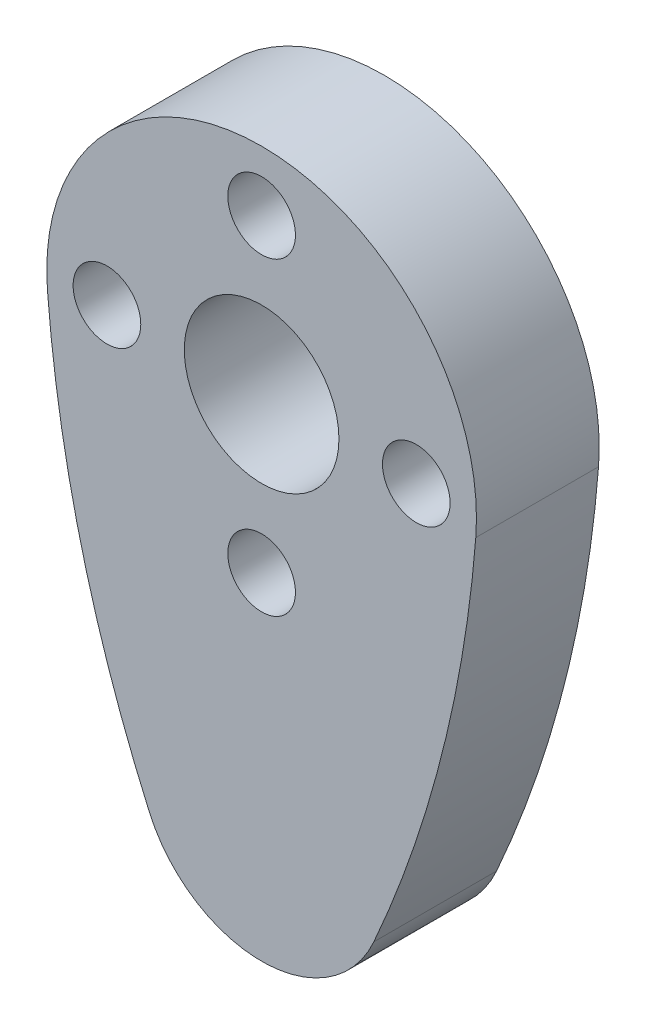
ISO-10303-21;
HEADER;
FILE_DESCRIPTION(('STEP AP214'),'2;1');
FILE_NAME('part.step','',(''),(''),'','','');
FILE_SCHEMA(('AUTOMOTIVE_DESIGN { 1 0 10303 214 1 1 1 1 }'));
ENDSEC;
DATA;
#1=APPLICATION_CONTEXT('core data for automotive mechanical design processes');
#2=APPLICATION_PROTOCOL_DEFINITION('international standard','automotive_design',2000,#1);
#3=PRODUCT_CONTEXT('',#1,'mechanical');
#4=PRODUCT('Part','Part','',(#3));
#5=PRODUCT_RELATED_PRODUCT_CATEGORY('part','',(#4));
#6=PRODUCT_DEFINITION_FORMATION('','',#4);
#7=PRODUCT_DEFINITION_CONTEXT('part definition',#1,'design');
#8=PRODUCT_DEFINITION('design','',#6,#7);
#9=PRODUCT_DEFINITION_SHAPE('','',#8);
#10=(LENGTH_UNIT() NAMED_UNIT(*) SI_UNIT(.MILLI.,.METRE.));
#11=(NAMED_UNIT(*) PLANE_ANGLE_UNIT() SI_UNIT($,.RADIAN.));
#12=(NAMED_UNIT(*) SI_UNIT($,.STERADIAN.) SOLID_ANGLE_UNIT());
#13=UNCERTAINTY_MEASURE_WITH_UNIT(LENGTH_MEASURE(1.E-05),#10,'distance_accuracy_value','');
#14=(GEOMETRIC_REPRESENTATION_CONTEXT(3) GLOBAL_UNCERTAINTY_ASSIGNED_CONTEXT((#13)) GLOBAL_UNIT_ASSIGNED_CONTEXT((#10,
#11,#12)) REPRESENTATION_CONTEXT('',''));
#15=CARTESIAN_POINT('',(0.,0.,0.));
#16=DIRECTION('',(0.,0.,1.));
#17=DIRECTION('',(1.,0.,0.));
#18=AXIS2_PLACEMENT_3D('',#15,#16,#17);
#19=CARTESIAN_POINT('',(26.1107482877734,-7.44140625,6.35));
#20=DIRECTION('',(0.,0.,1.));
#21=DIRECTION('',(1.,0.,0.));
#22=AXIS2_PLACEMENT_3D('',#19,#20,#21);
#23=PLANE('',#22);
#24=CARTESIAN_POINT('',(0.,-8.,6.35));
#25=DIRECTION('',(0.,0.,1.));
#26=DIRECTION('',(1.,0.,0.));
#27=AXIS2_PLACEMENT_3D('',#24,#25,#26);
#28=CIRCLE('',#27,1.75);
#29=CARTESIAN_POINT('',(1.74999999999997,-8.,6.35));
#30=VERTEX_POINT('',#29);
#31=EDGE_CURVE('E214',#30,#30,#28,.T.);
#32=ORIENTED_EDGE('',*,*,#31,.F.);
#33=EDGE_LOOP('',(#32));
#34=FACE_BOUND('',#33,.T.);
#35=CARTESIAN_POINT('',(0.,8.,6.35));
#36=DIRECTION('',(0.,0.,1.));
#37=DIRECTION('',(1.,0.,0.));
#38=AXIS2_PLACEMENT_3D('',#35,#36,#37);
#39=CIRCLE('',#38,1.75);
#40=CARTESIAN_POINT('',(1.75000000000008,8.,6.35));
#41=VERTEX_POINT('',#40);
#42=EDGE_CURVE('E202',#41,#41,#39,.T.);
#43=ORIENTED_EDGE('',*,*,#42,.F.);
#44=EDGE_LOOP('',(#43));
#45=FACE_BOUND('',#44,.T.);
#46=CARTESIAN_POINT('',(52.2214965755468,4.1671875,6.35));
#47=DIRECTION('',(0.,0.,1.));
#48=DIRECTION('',(1.,0.,0.));
#49=AXIS2_PLACEMENT_3D('',#46,#47,#48);
#50=CIRCLE('',#49,63.5);
#51=CARTESIAN_POINT('',(-11.0772871523887,-0.883948863636371,6.35));
#52=VERTEX_POINT('',#51);
#53=CARTESIAN_POINT('',(-5.80238850839407,-21.6296875,6.35));
#54=VERTEX_POINT('',#53);
#55=EDGE_CURVE('E166',#52,#54,#50,.T.);
#56=ORIENTED_EDGE('',*,*,#55,.T.);
#57=CARTESIAN_POINT('',(0.,-19.05,6.35));
#58=DIRECTION('',(0.,0.,-1.));
#59=DIRECTION('',(-1.,0.,0.));
#60=AXIS2_PLACEMENT_3D('',#57,#58,#59);
#61=CIRCLE('',#60,6.34999999999999);
#62=CARTESIAN_POINT('',(5.80238850839408,-21.6296875,6.35));
#63=VERTEX_POINT('',#62);
#64=EDGE_CURVE('E169',#63,#54,#61,.T.);
#65=ORIENTED_EDGE('',*,*,#64,.F.);
#66=CARTESIAN_POINT('',(-52.2214965755468,4.16718749999999,6.35));
#67=DIRECTION('',(0.,0.,1.));
#68=DIRECTION('',(1.,0.,0.));
#69=AXIS2_PLACEMENT_3D('',#66,#67,#68);
#70=CIRCLE('',#69,63.5);
#71=CARTESIAN_POINT('',(11.0772871523887,-0.883948863636357,6.35));
#72=VERTEX_POINT('',#71);
#73=EDGE_CURVE('E173',#63,#72,#70,.T.);
#74=ORIENTED_EDGE('',*,*,#73,.T.);
#75=CARTESIAN_POINT('',(0.,0.,6.35));
#76=DIRECTION('',(0.,0.,-1.));
#77=DIRECTION('',(-1.,0.,0.));
#78=AXIS2_PLACEMENT_3D('',#75,#76,#77);
#79=CIRCLE('',#78,11.1125);
#80=EDGE_CURVE('E182',#52,#72,#79,.T.);
#81=ORIENTED_EDGE('',*,*,#80,.F.);
#82=EDGE_LOOP('',(#56,#65,#74,#81));
#83=FACE_BOUND('',#82,.T.);
#84=CARTESIAN_POINT('',(-8.,0.,6.35));
#85=DIRECTION('',(0.,0.,1.));
#86=DIRECTION('',(1.,0.,0.));
#87=AXIS2_PLACEMENT_3D('',#84,#85,#86);
#88=CIRCLE('',#87,1.75);
#89=CARTESIAN_POINT('',(-6.25,0.,6.35));
#90=VERTEX_POINT('',#89);
#91=EDGE_CURVE('E189',#90,#90,#88,.T.);
#92=ORIENTED_EDGE('',*,*,#91,.F.);
#93=EDGE_LOOP('',(#92));
#94=FACE_BOUND('',#93,.T.);
#95=CARTESIAN_POINT('',(0.,0.,6.35));
#96=DIRECTION('',(0.,0.,1.));
#97=DIRECTION('',(1.,0.,0.));
#98=AXIS2_PLACEMENT_3D('',#95,#96,#97);
#99=CIRCLE('',#98,4.);
#100=CARTESIAN_POINT('',(4.,0.,6.35));
#101=VERTEX_POINT('',#100);
#102=EDGE_CURVE('E208',#101,#101,#99,.T.);
#103=ORIENTED_EDGE('',*,*,#102,.F.);
#104=EDGE_LOOP('',(#103));
#105=FACE_BOUND('',#104,.T.);
#106=CARTESIAN_POINT('',(8.,0.,6.35));
#107=DIRECTION('',(0.,0.,1.));
#108=DIRECTION('',(1.,0.,0.));
#109=AXIS2_PLACEMENT_3D('',#106,#107,#108);
#110=CIRCLE('',#109,1.75);
#111=CARTESIAN_POINT('',(9.75,0.,6.35));
#112=VERTEX_POINT('',#111);
#113=EDGE_CURVE('E220',#112,#112,#110,.T.);
#114=ORIENTED_EDGE('',*,*,#113,.F.);
#115=EDGE_LOOP('',(#114));
#116=FACE_BOUND('',#115,.T.);
#117=ADVANCED_FACE('F123',(#34,#45,#83,#94,#105,#116),#23,.T.);
#118=CARTESIAN_POINT('',(26.1107482877734,-7.44140625,0.));
#119=DIRECTION('',(0.,0.,1.));
#120=DIRECTION('',(1.,0.,0.));
#121=AXIS2_PLACEMENT_3D('',#118,#119,#120);
#122=PLANE('',#121);
#123=CARTESIAN_POINT('',(0.,-8.,0.));
#124=DIRECTION('',(0.,0.,1.));
#125=DIRECTION('',(1.,0.,0.));
#126=AXIS2_PLACEMENT_3D('',#123,#124,#125);
#127=CIRCLE('',#126,1.75);
#128=CARTESIAN_POINT('',(1.74999999999997,-8.,0.));
#129=VERTEX_POINT('',#128);
#130=EDGE_CURVE('E217',#129,#129,#127,.T.);
#131=ORIENTED_EDGE('',*,*,#130,.T.);
#132=EDGE_LOOP('',(#131));
#133=FACE_BOUND('',#132,.T.);
#134=CARTESIAN_POINT('',(0.,8.,0.));
#135=DIRECTION('',(0.,0.,1.));
#136=DIRECTION('',(1.,0.,0.));
#137=AXIS2_PLACEMENT_3D('',#134,#135,#136);
#138=CIRCLE('',#137,1.75);
#139=CARTESIAN_POINT('',(1.75000000000008,8.,0.));
#140=VERTEX_POINT('',#139);
#141=EDGE_CURVE('E205',#140,#140,#138,.T.);
#142=ORIENTED_EDGE('',*,*,#141,.T.);
#143=EDGE_LOOP('',(#142));
#144=FACE_BOUND('',#143,.T.);
#145=CARTESIAN_POINT('',(52.2214965755468,4.1671875,0.));
#146=DIRECTION('',(0.,0.,1.));
#147=DIRECTION('',(1.,0.,0.));
#148=AXIS2_PLACEMENT_3D('',#145,#146,#147);
#149=CIRCLE('',#148,63.5);
#150=CARTESIAN_POINT('',(-11.0772871523887,-0.883948863636371,0.));
#151=VERTEX_POINT('',#150);
#152=CARTESIAN_POINT('',(-5.80238850839407,-21.6296875,0.));
#153=VERTEX_POINT('',#152);
#154=EDGE_CURVE('E187',#151,#153,#149,.T.);
#155=ORIENTED_EDGE('',*,*,#154,.F.);
#156=CARTESIAN_POINT('',(0.,0.,0.));
#157=DIRECTION('',(0.,0.,-1.));
#158=DIRECTION('',(-1.,0.,0.));
#159=AXIS2_PLACEMENT_3D('',#156,#157,#158);
#160=CIRCLE('',#159,11.1125);
#161=CARTESIAN_POINT('',(11.0772871523887,-0.883948863636357,0.));
#162=VERTEX_POINT('',#161);
#163=EDGE_CURVE('E193',#151,#162,#160,.T.);
#164=ORIENTED_EDGE('',*,*,#163,.T.);
#165=CARTESIAN_POINT('',(-52.2214965755468,4.16718749999999,0.));
#166=DIRECTION('',(0.,0.,1.));
#167=DIRECTION('',(1.,0.,0.));
#168=AXIS2_PLACEMENT_3D('',#165,#166,#167);
#169=CIRCLE('',#168,63.5);
#170=CARTESIAN_POINT('',(5.80238850839408,-21.6296875,0.));
#171=VERTEX_POINT('',#170);
#172=EDGE_CURVE('E191',#171,#162,#169,.T.);
#173=ORIENTED_EDGE('',*,*,#172,.F.);
#174=CARTESIAN_POINT('',(0.,-19.05,0.));
#175=DIRECTION('',(0.,0.,1.));
#176=DIRECTION('',(1.,0.,0.));
#177=AXIS2_PLACEMENT_3D('',#174,#175,#176);
#178=CIRCLE('',#177,6.35);
#179=EDGE_CURVE('E178',#153,#171,#178,.T.);
#180=ORIENTED_EDGE('',*,*,#179,.F.);
#181=EDGE_LOOP('',(#155,#164,#173,#180));
#182=FACE_BOUND('',#181,.T.);
#183=CARTESIAN_POINT('',(-8.,0.,0.));
#184=DIRECTION('',(0.,0.,1.));
#185=DIRECTION('',(1.,0.,0.));
#186=AXIS2_PLACEMENT_3D('',#183,#184,#185);
#187=CIRCLE('',#186,1.75);
#188=CARTESIAN_POINT('',(-6.25,0.,0.));
#189=VERTEX_POINT('',#188);
#190=EDGE_CURVE('E199',#189,#189,#187,.T.);
#191=ORIENTED_EDGE('',*,*,#190,.T.);
#192=EDGE_LOOP('',(#191));
#193=FACE_BOUND('',#192,.T.);
#194=CARTESIAN_POINT('',(0.,0.,0.));
#195=DIRECTION('',(0.,0.,1.));
#196=DIRECTION('',(1.,0.,0.));
#197=AXIS2_PLACEMENT_3D('',#194,#195,#196);
#198=CIRCLE('',#197,4.);
#199=CARTESIAN_POINT('',(4.,0.,0.));
#200=VERTEX_POINT('',#199);
#201=EDGE_CURVE('E211',#200,#200,#198,.T.);
#202=ORIENTED_EDGE('',*,*,#201,.T.);
#203=EDGE_LOOP('',(#202));
#204=FACE_BOUND('',#203,.T.);
#205=CARTESIAN_POINT('',(8.,0.,0.));
#206=DIRECTION('',(0.,0.,1.));
#207=DIRECTION('',(1.,0.,0.));
#208=AXIS2_PLACEMENT_3D('',#205,#206,#207);
#209=CIRCLE('',#208,1.75);
#210=CARTESIAN_POINT('',(9.75,0.,0.));
#211=VERTEX_POINT('',#210);
#212=EDGE_CURVE('E223',#211,#211,#209,.T.);
#213=ORIENTED_EDGE('',*,*,#212,.T.);
#214=EDGE_LOOP('',(#213));
#215=FACE_BOUND('',#214,.T.);
#216=ADVANCED_FACE('F233',(#133,#144,#182,#193,#204,#215),#122,.F.);
#217=CARTESIAN_POINT('',(52.2214965755468,4.1671875,6.35));
#218=DIRECTION('',(0.,0.,-1.));
#219=DIRECTION('',(-1.,0.,0.));
#220=AXIS2_PLACEMENT_3D('',#217,#218,#219);
#221=CYLINDRICAL_SURFACE('',#220,63.5);
#222=ORIENTED_EDGE('',*,*,#154,.T.);
#223=DIRECTION('',(0.,0.,-1.));
#224=VECTOR('',#223,1.);
#225=CARTESIAN_POINT('',(-5.80238850839407,-21.6296875,6.35));
#226=LINE('',#225,#224);
#227=EDGE_CURVE('E12',#54,#153,#226,.T.);
#228=ORIENTED_EDGE('',*,*,#227,.F.);
#229=ORIENTED_EDGE('',*,*,#55,.F.);
#230=DIRECTION('',(0.,0.,-1.));
#231=VECTOR('',#230,1.);
#232=CARTESIAN_POINT('',(-11.0772871523887,-0.883948863636371,6.35));
#233=LINE('',#232,#231);
#234=EDGE_CURVE('E140',#52,#151,#233,.T.);
#235=ORIENTED_EDGE('',*,*,#234,.T.);
#236=EDGE_LOOP('',(#222,#228,#229,#235));
#237=FACE_BOUND('',#236,.T.);
#238=ADVANCED_FACE('F125',(#237),#221,.T.);
#239=CARTESIAN_POINT('',(0.,-19.05,6.35));
#240=DIRECTION('',(0.,0.,-1.));
#241=DIRECTION('',(-1.,0.,0.));
#242=AXIS2_PLACEMENT_3D('',#239,#240,#241);
#243=CYLINDRICAL_SURFACE('',#242,6.35);
#244=ORIENTED_EDGE('',*,*,#179,.T.);
#245=DIRECTION('',(0.,0.,-1.));
#246=VECTOR('',#245,1.);
#247=CARTESIAN_POINT('',(5.80238850839408,-21.6296875,6.35));
#248=LINE('',#247,#246);
#249=EDGE_CURVE('E132',#63,#171,#248,.T.);
#250=ORIENTED_EDGE('',*,*,#249,.F.);
#251=ORIENTED_EDGE('',*,*,#64,.T.);
#252=ORIENTED_EDGE('',*,*,#227,.T.);
#253=EDGE_LOOP('',(#244,#250,#251,#252));
#254=FACE_BOUND('',#253,.T.);
#255=ADVANCED_FACE('F177',(#254),#243,.T.);
#256=CARTESIAN_POINT('',(-52.2214965755468,4.16718749999999,6.35));
#257=DIRECTION('',(0.,0.,-1.));
#258=DIRECTION('',(-1.,0.,0.));
#259=AXIS2_PLACEMENT_3D('',#256,#257,#258);
#260=CYLINDRICAL_SURFACE('',#259,63.5);
#261=ORIENTED_EDGE('',*,*,#172,.T.);
#262=DIRECTION('',(0.,0.,-1.));
#263=VECTOR('',#262,1.);
#264=CARTESIAN_POINT('',(11.0772871523887,-0.883948863636357,6.35));
#265=LINE('',#264,#263);
#266=EDGE_CURVE('E155',#72,#162,#265,.T.);
#267=ORIENTED_EDGE('',*,*,#266,.F.);
#268=ORIENTED_EDGE('',*,*,#73,.F.);
#269=ORIENTED_EDGE('',*,*,#249,.T.);
#270=EDGE_LOOP('',(#261,#267,#268,#269));
#271=FACE_BOUND('',#270,.T.);
#272=ADVANCED_FACE('F181',(#271),#260,.T.);
#273=CARTESIAN_POINT('',(0.,0.,6.35));
#274=DIRECTION('',(0.,0.,-1.));
#275=DIRECTION('',(-1.,0.,0.));
#276=AXIS2_PLACEMENT_3D('',#273,#274,#275);
#277=CYLINDRICAL_SURFACE('',#276,11.1125);
#278=ORIENTED_EDGE('',*,*,#163,.F.);
#279=ORIENTED_EDGE('',*,*,#234,.F.);
#280=ORIENTED_EDGE('',*,*,#80,.T.);
#281=ORIENTED_EDGE('',*,*,#266,.T.);
#282=EDGE_LOOP('',(#278,#279,#280,#281));
#283=FACE_BOUND('',#282,.T.);
#284=ADVANCED_FACE('F247',(#283),#277,.T.);
#285=CARTESIAN_POINT('',(-8.,0.,6.35));
#286=DIRECTION('',(0.,0.,-1.));
#287=DIRECTION('',(-1.,0.,0.));
#288=AXIS2_PLACEMENT_3D('',#285,#286,#287);
#289=CYLINDRICAL_SURFACE('',#288,1.75);
#290=ORIENTED_EDGE('',*,*,#91,.T.);
#291=EDGE_LOOP('',(#290));
#292=FACE_BOUND('',#291,.T.);
#293=ORIENTED_EDGE('',*,*,#190,.F.);
#294=EDGE_LOOP('',(#293));
#295=FACE_BOUND('',#294,.T.);
#296=ADVANCED_FACE('F244',(#292,#295),#289,.F.);
#297=CARTESIAN_POINT('',(0.,8.,6.35));
#298=DIRECTION('',(0.,0.,-1.));
#299=DIRECTION('',(-1.,0.,0.));
#300=AXIS2_PLACEMENT_3D('',#297,#298,#299);
#301=CYLINDRICAL_SURFACE('',#300,1.75);
#302=ORIENTED_EDGE('',*,*,#42,.T.);
#303=EDGE_LOOP('',(#302));
#304=FACE_BOUND('',#303,.T.);
#305=ORIENTED_EDGE('',*,*,#141,.F.);
#306=EDGE_LOOP('',(#305));
#307=FACE_BOUND('',#306,.T.);
#308=ADVANCED_FACE('F274',(#304,#307),#301,.F.);
#309=CARTESIAN_POINT('',(0.,0.,6.35));
#310=DIRECTION('',(0.,0.,-1.));
#311=DIRECTION('',(-1.,0.,0.));
#312=AXIS2_PLACEMENT_3D('',#309,#310,#311);
#313=CYLINDRICAL_SURFACE('',#312,4.);
#314=ORIENTED_EDGE('',*,*,#102,.T.);
#315=EDGE_LOOP('',(#314));
#316=FACE_BOUND('',#315,.T.);
#317=ORIENTED_EDGE('',*,*,#201,.F.);
#318=EDGE_LOOP('',(#317));
#319=FACE_BOUND('',#318,.T.);
#320=ADVANCED_FACE('F269',(#316,#319),#313,.F.);
#321=CARTESIAN_POINT('',(0.,-8.,6.35));
#322=DIRECTION('',(0.,0.,-1.));
#323=DIRECTION('',(-1.,0.,0.));
#324=AXIS2_PLACEMENT_3D('',#321,#322,#323);
#325=CYLINDRICAL_SURFACE('',#324,1.75);
#326=ORIENTED_EDGE('',*,*,#31,.T.);
#327=EDGE_LOOP('',(#326));
#328=FACE_BOUND('',#327,.T.);
#329=ORIENTED_EDGE('',*,*,#130,.F.);
#330=EDGE_LOOP('',(#329));
#331=FACE_BOUND('',#330,.T.);
#332=ADVANCED_FACE('F264',(#328,#331),#325,.F.);
#333=CARTESIAN_POINT('',(8.,0.,6.35));
#334=DIRECTION('',(0.,0.,-1.));
#335=DIRECTION('',(-1.,0.,0.));
#336=AXIS2_PLACEMENT_3D('',#333,#334,#335);
#337=CYLINDRICAL_SURFACE('',#336,1.75);
#338=ORIENTED_EDGE('',*,*,#113,.T.);
#339=EDGE_LOOP('',(#338));
#340=FACE_BOUND('',#339,.T.);
#341=ORIENTED_EDGE('',*,*,#212,.F.);
#342=EDGE_LOOP('',(#341));
#343=FACE_BOUND('',#342,.T.);
#344=ADVANCED_FACE('F229',(#340,#343),#337,.F.);
#345=CLOSED_SHELL('',(#117,#216,#238,#255,#272,#284,#296,#308,#320,#332,#344));
#346=MANIFOLD_SOLID_BREP('B2',#345);
#347=ADVANCED_BREP_SHAPE_REPRESENTATION('',(#18,#346),#14);
#348=SHAPE_DEFINITION_REPRESENTATION(#9,#347);
ENDSEC;
END-ISO-10303-21;
